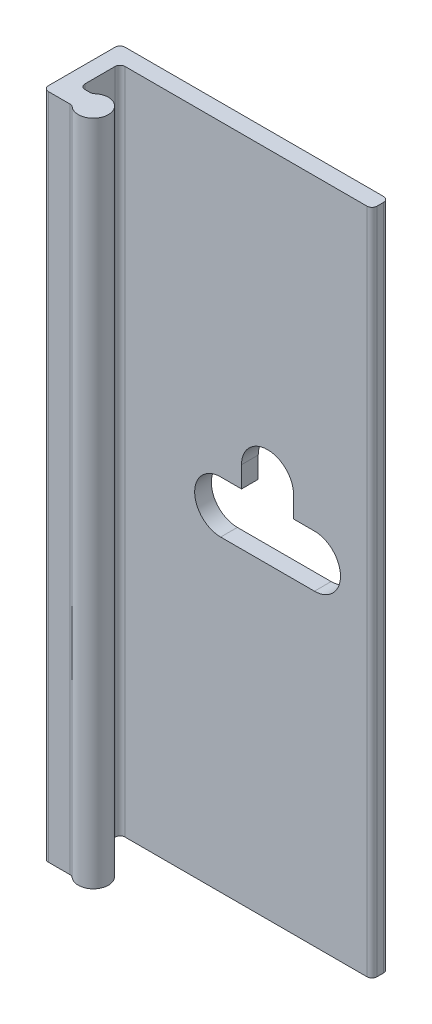
ISO-10303-21;
HEADER;
FILE_DESCRIPTION(('STEP AP214'),'2;1');
FILE_NAME('part.step','',(''),(''),'','','');
FILE_SCHEMA(('AUTOMOTIVE_DESIGN { 1 0 10303 214 1 1 1 1 }'));
ENDSEC;
DATA;
#1=APPLICATION_CONTEXT('core data for automotive mechanical design processes');
#2=APPLICATION_PROTOCOL_DEFINITION('international standard','automotive_design',2000,#1);
#3=PRODUCT_CONTEXT('',#1,'mechanical');
#4=PRODUCT('Part','Part','',(#3));
#5=PRODUCT_RELATED_PRODUCT_CATEGORY('part','',(#4));
#6=PRODUCT_DEFINITION_FORMATION('','',#4);
#7=PRODUCT_DEFINITION_CONTEXT('part definition',#1,'design');
#8=PRODUCT_DEFINITION('design','',#6,#7);
#9=PRODUCT_DEFINITION_SHAPE('','',#8);
#10=(LENGTH_UNIT() NAMED_UNIT(*) SI_UNIT(.MILLI.,.METRE.));
#11=(NAMED_UNIT(*) PLANE_ANGLE_UNIT() SI_UNIT($,.RADIAN.));
#12=(NAMED_UNIT(*) SI_UNIT($,.STERADIAN.) SOLID_ANGLE_UNIT());
#13=UNCERTAINTY_MEASURE_WITH_UNIT(LENGTH_MEASURE(1.E-05),#10,'distance_accuracy_value','');
#14=(GEOMETRIC_REPRESENTATION_CONTEXT(3) GLOBAL_UNCERTAINTY_ASSIGNED_CONTEXT((#13)) GLOBAL_UNIT_ASSIGNED_CONTEXT((#10,
#11,#12)) REPRESENTATION_CONTEXT('',''));
#15=CARTESIAN_POINT('',(0.,0.,0.));
#16=DIRECTION('',(0.,0.,1.));
#17=DIRECTION('',(1.,0.,0.));
#18=AXIS2_PLACEMENT_3D('',#15,#16,#17);
#19=CARTESIAN_POINT('',(-0.634999999999999,50.8,1.651));
#20=DIRECTION('',(1.,0.,0.));
#21=DIRECTION('',(0.,0.,-1.));
#22=AXIS2_PLACEMENT_3D('',#19,#20,#21);
#23=PLANE('',#22);
#24=DIRECTION('',(0.,0.,1.));
#25=VECTOR('',#24,1.);
#26=CARTESIAN_POINT('',(-0.634999999999999,0.,1.651));
#27=LINE('',#26,#25);
#28=CARTESIAN_POINT('',(-0.634999999999999,0.,0.381));
#29=VERTEX_POINT('',#28);
#30=CARTESIAN_POINT('',(-0.634999999999999,0.,5.461));
#31=VERTEX_POINT('',#30);
#32=EDGE_CURVE('E251',#29,#31,#27,.T.);
#33=ORIENTED_EDGE('',*,*,#32,.T.);
#34=DIRECTION('',(0.,-1.,0.));
#35=VECTOR('',#34,1.);
#36=CARTESIAN_POINT('',(-0.634999999999999,50.8,5.461));
#37=LINE('',#36,#35);
#38=CARTESIAN_POINT('',(-0.634999999999999,50.8,5.461));
#39=VERTEX_POINT('',#38);
#40=EDGE_CURVE('E368',#31,#39,#37,.F.);
#41=ORIENTED_EDGE('',*,*,#40,.T.);
#42=DIRECTION('',(0.,0.,1.));
#43=VECTOR('',#42,1.);
#44=CARTESIAN_POINT('',(-0.634999999999999,50.8,1.651));
#45=LINE('',#44,#43);
#46=CARTESIAN_POINT('',(-0.634999999999999,50.8,0.381));
#47=VERTEX_POINT('',#46);
#48=EDGE_CURVE('E263',#47,#39,#45,.T.);
#49=ORIENTED_EDGE('',*,*,#48,.F.);
#50=DIRECTION('',(0.,-1.,0.));
#51=VECTOR('',#50,1.);
#52=CARTESIAN_POINT('',(-0.634999999999999,50.8,0.381));
#53=LINE('',#52,#51);
#54=EDGE_CURVE('E365',#47,#29,#53,.T.);
#55=ORIENTED_EDGE('',*,*,#54,.T.);
#56=EDGE_LOOP('',(#33,#41,#49,#55));
#57=FACE_BOUND('',#56,.T.);
#58=ADVANCED_FACE('F34',(#57),#23,.F.);
#59=CARTESIAN_POINT('',(-1.40496875048439,50.8,5.842));
#60=DIRECTION('',(0.,0.,-1.));
#61=DIRECTION('',(-1.,0.,0.));
#62=AXIS2_PLACEMENT_3D('',#59,#60,#61);
#63=PLANE('',#62);
#64=DIRECTION('',(1.,0.,0.));
#65=VECTOR('',#64,1.);
#66=CARTESIAN_POINT('',(-1.40496875048439,50.8,5.842));
#67=LINE('',#66,#65);
#68=CARTESIAN_POINT('',(-0.253999999999998,50.8,5.842));
#69=VERTEX_POINT('',#68);
#70=CARTESIAN_POINT('',(1.40496875048439,50.8,5.842));
#71=VERTEX_POINT('',#70);
#72=EDGE_CURVE('E266',#69,#71,#67,.T.);
#73=ORIENTED_EDGE('',*,*,#72,.F.);
#74=DIRECTION('',(0.,-1.,0.));
#75=VECTOR('',#74,1.);
#76=CARTESIAN_POINT('',(-0.253999999999998,50.8,5.842));
#77=LINE('',#76,#75);
#78=CARTESIAN_POINT('',(-0.253999999999998,0.,5.842));
#79=VERTEX_POINT('',#78);
#80=EDGE_CURVE('E358',#69,#79,#77,.T.);
#81=ORIENTED_EDGE('',*,*,#80,.T.);
#82=DIRECTION('',(1.,0.,0.));
#83=VECTOR('',#82,1.);
#84=CARTESIAN_POINT('',(-1.40496875048439,0.,5.842));
#85=LINE('',#84,#83);
#86=CARTESIAN_POINT('',(1.40496875048439,0.,5.842));
#87=VERTEX_POINT('',#86);
#88=EDGE_CURVE('E297',#79,#87,#85,.T.);
#89=ORIENTED_EDGE('',*,*,#88,.T.);
#90=DIRECTION('',(0.,-1.,0.));
#91=VECTOR('',#90,1.);
#92=CARTESIAN_POINT('',(1.40496875048439,50.8,5.842));
#93=LINE('',#92,#91);
#94=EDGE_CURVE('E355',#71,#87,#93,.T.);
#95=ORIENTED_EDGE('',*,*,#94,.F.);
#96=EDGE_LOOP('',(#73,#81,#89,#95));
#97=FACE_BOUND('',#96,.T.);
#98=ADVANCED_FACE('F381',(#97),#63,.F.);
#99=CARTESIAN_POINT('',(1.40496875048439,50.8,6.223));
#100=DIRECTION('',(0.,-1.,0.));
#101=DIRECTION('',(0.,0.,-1.));
#102=AXIS2_PLACEMENT_3D('',#99,#100,#101);
#103=CYLINDRICAL_SURFACE('',#102,0.381);
#104=CARTESIAN_POINT('',(1.40496875048439,0.,6.223));
#105=DIRECTION('',(0.,-1.,0.));
#106=DIRECTION('',(0.,0.,-1.));
#107=AXIS2_PLACEMENT_3D('',#104,#105,#106);
#108=CIRCLE('',#107,0.381);
#109=CARTESIAN_POINT('',(1.65697656286329,0.,5.93725));
#110=VERTEX_POINT('',#109);
#111=EDGE_CURVE('E299',#87,#110,#108,.T.);
#112=ORIENTED_EDGE('',*,*,#111,.T.);
#113=DIRECTION('',(0.,-1.,0.));
#114=VECTOR('',#113,1.);
#115=CARTESIAN_POINT('',(1.65697656286329,50.8,5.93725));
#116=LINE('',#115,#114);
#117=CARTESIAN_POINT('',(1.65697656286329,50.8,5.93725));
#118=VERTEX_POINT('',#117);
#119=EDGE_CURVE('E352',#118,#110,#116,.T.);
#120=ORIENTED_EDGE('',*,*,#119,.F.);
#121=CARTESIAN_POINT('',(1.40496875048439,50.8,6.223));
#122=DIRECTION('',(0.,-1.,0.));
#123=DIRECTION('',(0.,0.,-1.));
#124=AXIS2_PLACEMENT_3D('',#121,#122,#123);
#125=CIRCLE('',#124,0.381);
#126=EDGE_CURVE('E269',#71,#118,#125,.T.);
#127=ORIENTED_EDGE('',*,*,#126,.F.);
#128=ORIENTED_EDGE('',*,*,#94,.T.);
#129=EDGE_LOOP('',(#112,#120,#127,#128));
#130=FACE_BOUND('',#129,.T.);
#131=ADVANCED_FACE('F448',(#130),#103,.F.);
#132=CARTESIAN_POINT('',(2.413,50.8,5.08));
#133=DIRECTION('',(0.,-1.,0.));
#134=DIRECTION('',(0.,0.,-1.));
#135=AXIS2_PLACEMENT_3D('',#132,#133,#134);
#136=CYLINDRICAL_SURFACE('',#135,1.143);
#137=CARTESIAN_POINT('',(2.413,0.,5.08));
#138=DIRECTION('',(0.,1.,0.));
#139=DIRECTION('',(0.,0.,1.));
#140=AXIS2_PLACEMENT_3D('',#137,#138,#139);
#141=CIRCLE('',#140,1.143);
#142=CARTESIAN_POINT('',(1.6569765628633,0.,4.22275));
#143=VERTEX_POINT('',#142);
#144=EDGE_CURVE('E301',#110,#143,#141,.T.);
#145=ORIENTED_EDGE('',*,*,#144,.T.);
#146=DIRECTION('',(0.,-1.,0.));
#147=VECTOR('',#146,1.);
#148=CARTESIAN_POINT('',(1.6569765628633,50.8,4.22275));
#149=LINE('',#148,#147);
#150=CARTESIAN_POINT('',(1.6569765628633,50.8,4.22275));
#151=VERTEX_POINT('',#150);
#152=EDGE_CURVE('E349',#151,#143,#149,.T.);
#153=ORIENTED_EDGE('',*,*,#152,.F.);
#154=CARTESIAN_POINT('',(2.413,50.8,5.08));
#155=DIRECTION('',(0.,1.,0.));
#156=DIRECTION('',(0.,0.,1.));
#157=AXIS2_PLACEMENT_3D('',#154,#155,#156);
#158=CIRCLE('',#157,1.143);
#159=EDGE_CURVE('E271',#118,#151,#158,.T.);
#160=ORIENTED_EDGE('',*,*,#159,.F.);
#161=ORIENTED_EDGE('',*,*,#119,.T.);
#162=EDGE_LOOP('',(#145,#153,#160,#161));
#163=FACE_BOUND('',#162,.T.);
#164=ADVANCED_FACE('F445',(#163),#136,.T.);
#165=CARTESIAN_POINT('',(1.40496875048439,50.8,3.937));
#166=DIRECTION('',(0.,-1.,0.));
#167=DIRECTION('',(0.,0.,-1.));
#168=AXIS2_PLACEMENT_3D('',#165,#166,#167);
#169=CYLINDRICAL_SURFACE('',#168,0.381000000000001);
#170=CARTESIAN_POINT('',(1.40496875048439,0.,3.937));
#171=DIRECTION('',(0.,-1.,0.));
#172=DIRECTION('',(0.,0.,-1.));
#173=AXIS2_PLACEMENT_3D('',#170,#171,#172);
#174=CIRCLE('',#173,0.381000000000001);
#175=CARTESIAN_POINT('',(1.40496875048439,0.,4.318));
#176=VERTEX_POINT('',#175);
#177=EDGE_CURVE('E303',#143,#176,#174,.T.);
#178=ORIENTED_EDGE('',*,*,#177,.T.);
#179=DIRECTION('',(0.,-1.,0.));
#180=VECTOR('',#179,1.);
#181=CARTESIAN_POINT('',(1.40496875048439,50.8,4.318));
#182=LINE('',#181,#180);
#183=CARTESIAN_POINT('',(1.40496875048439,50.8,4.318));
#184=VERTEX_POINT('',#183);
#185=EDGE_CURVE('E346',#184,#176,#182,.T.);
#186=ORIENTED_EDGE('',*,*,#185,.F.);
#187=CARTESIAN_POINT('',(1.40496875048439,50.8,3.937));
#188=DIRECTION('',(0.,-1.,0.));
#189=DIRECTION('',(0.,0.,-1.));
#190=AXIS2_PLACEMENT_3D('',#187,#188,#189);
#191=CIRCLE('',#190,0.381000000000001);
#192=EDGE_CURVE('E273',#151,#184,#191,.T.);
#193=ORIENTED_EDGE('',*,*,#192,.F.);
#194=ORIENTED_EDGE('',*,*,#152,.T.);
#195=EDGE_LOOP('',(#178,#186,#193,#194));
#196=FACE_BOUND('',#195,.T.);
#197=ADVANCED_FACE('F441',(#196),#169,.F.);
#198=CARTESIAN_POINT('',(1.016,50.8,4.318));
#199=DIRECTION('',(0.,0.,1.));
#200=DIRECTION('',(1.,0.,0.));
#201=AXIS2_PLACEMENT_3D('',#198,#199,#200);
#202=PLANE('',#201);
#203=DIRECTION('',(-1.,0.,0.));
#204=VECTOR('',#203,1.);
#205=CARTESIAN_POINT('',(1.016,0.,4.318));
#206=LINE('',#205,#204);
#207=CARTESIAN_POINT('',(1.016,0.,4.318));
#208=VERTEX_POINT('',#207);
#209=EDGE_CURVE('E305',#176,#208,#206,.T.);
#210=ORIENTED_EDGE('',*,*,#209,.T.);
#211=DIRECTION('',(0.,-1.,0.));
#212=VECTOR('',#211,1.);
#213=CARTESIAN_POINT('',(1.016,50.8,4.318));
#214=LINE('',#213,#212);
#215=CARTESIAN_POINT('',(1.016,50.8,4.318));
#216=VERTEX_POINT('',#215);
#217=EDGE_CURVE('E343',#216,#208,#214,.T.);
#218=ORIENTED_EDGE('',*,*,#217,.F.);
#219=DIRECTION('',(-1.,0.,0.));
#220=VECTOR('',#219,1.);
#221=CARTESIAN_POINT('',(1.016,50.8,4.318));
#222=LINE('',#221,#220);
#223=EDGE_CURVE('E275',#184,#216,#222,.T.);
#224=ORIENTED_EDGE('',*,*,#223,.F.);
#225=ORIENTED_EDGE('',*,*,#185,.T.);
#226=EDGE_LOOP('',(#210,#218,#224,#225));
#227=FACE_BOUND('',#226,.T.);
#228=ADVANCED_FACE('F436',(#227),#202,.F.);
#229=CARTESIAN_POINT('',(1.016,50.8,3.937));
#230=DIRECTION('',(0.,-1.,0.));
#231=DIRECTION('',(0.,0.,-1.));
#232=AXIS2_PLACEMENT_3D('',#229,#230,#231);
#233=CYLINDRICAL_SURFACE('',#232,0.381);
#234=CARTESIAN_POINT('',(1.016,0.,3.937));
#235=DIRECTION('',(0.,-1.,0.));
#236=DIRECTION('',(0.,0.,1.));
#237=AXIS2_PLACEMENT_3D('',#234,#235,#236);
#238=CIRCLE('',#237,0.381);
#239=CARTESIAN_POINT('',(0.635000000000002,0.,3.937));
#240=VERTEX_POINT('',#239);
#241=EDGE_CURVE('E307',#208,#240,#238,.T.);
#242=ORIENTED_EDGE('',*,*,#241,.T.);
#243=DIRECTION('',(0.,-1.,0.));
#244=VECTOR('',#243,1.);
#245=CARTESIAN_POINT('',(0.635000000000002,50.8,3.937));
#246=LINE('',#245,#244);
#247=CARTESIAN_POINT('',(0.635000000000002,50.8,3.937));
#248=VERTEX_POINT('',#247);
#249=EDGE_CURVE('E340',#248,#240,#246,.T.);
#250=ORIENTED_EDGE('',*,*,#249,.F.);
#251=CARTESIAN_POINT('',(1.016,50.8,3.937));
#252=DIRECTION('',(0.,-1.,0.));
#253=DIRECTION('',(0.,0.,1.));
#254=AXIS2_PLACEMENT_3D('',#251,#252,#253);
#255=CIRCLE('',#254,0.381);
#256=EDGE_CURVE('E277',#216,#248,#255,.T.);
#257=ORIENTED_EDGE('',*,*,#256,.F.);
#258=ORIENTED_EDGE('',*,*,#217,.T.);
#259=EDGE_LOOP('',(#242,#250,#257,#258));
#260=FACE_BOUND('',#259,.T.);
#261=ADVANCED_FACE('F430',(#260),#233,.F.);
#262=CARTESIAN_POINT('',(0.635000000000001,50.8,1.651));
#263=DIRECTION('',(-1.,0.,0.));
#264=DIRECTION('',(0.,0.,1.));
#265=AXIS2_PLACEMENT_3D('',#262,#263,#264);
#266=PLANE('',#265);
#267=DIRECTION('',(0.,0.,-1.));
#268=VECTOR('',#267,1.);
#269=CARTESIAN_POINT('',(0.635000000000001,0.,1.651));
#270=LINE('',#269,#268);
#271=CARTESIAN_POINT('',(0.635000000000001,0.,1.651));
#272=VERTEX_POINT('',#271);
#273=EDGE_CURVE('E309',#240,#272,#270,.T.);
#274=ORIENTED_EDGE('',*,*,#273,.T.);
#275=DIRECTION('',(0.,-1.,0.));
#276=VECTOR('',#275,1.);
#277=CARTESIAN_POINT('',(0.635000000000001,50.8,1.651));
#278=LINE('',#277,#276);
#279=CARTESIAN_POINT('',(0.635000000000001,50.8,1.651));
#280=VERTEX_POINT('',#279);
#281=EDGE_CURVE('E337',#280,#272,#278,.T.);
#282=ORIENTED_EDGE('',*,*,#281,.F.);
#283=DIRECTION('',(0.,0.,-1.));
#284=VECTOR('',#283,1.);
#285=CARTESIAN_POINT('',(0.635000000000001,50.8,1.651));
#286=LINE('',#285,#284);
#287=EDGE_CURVE('E279',#248,#280,#286,.T.);
#288=ORIENTED_EDGE('',*,*,#287,.F.);
#289=ORIENTED_EDGE('',*,*,#249,.T.);
#290=EDGE_LOOP('',(#274,#282,#288,#289));
#291=FACE_BOUND('',#290,.T.);
#292=ADVANCED_FACE('F426',(#291),#266,.F.);
#293=CARTESIAN_POINT('',(1.016,50.8,1.651));
#294=DIRECTION('',(0.,-1.,0.));
#295=DIRECTION('',(0.,0.,-1.));
#296=AXIS2_PLACEMENT_3D('',#293,#294,#295);
#297=CYLINDRICAL_SURFACE('',#296,0.381000000000001);
#298=CARTESIAN_POINT('',(1.016,0.,1.651));
#299=DIRECTION('',(0.,-1.,0.));
#300=DIRECTION('',(0.,0.,1.));
#301=AXIS2_PLACEMENT_3D('',#298,#299,#300);
#302=CIRCLE('',#301,0.381000000000001);
#303=CARTESIAN_POINT('',(1.016,0.,1.27));
#304=VERTEX_POINT('',#303);
#305=EDGE_CURVE('E311',#272,#304,#302,.T.);
#306=ORIENTED_EDGE('',*,*,#305,.T.);
#307=DIRECTION('',(0.,-1.,0.));
#308=VECTOR('',#307,1.);
#309=CARTESIAN_POINT('',(1.016,50.8,1.27));
#310=LINE('',#309,#308);
#311=CARTESIAN_POINT('',(1.016,50.8,1.27));
#312=VERTEX_POINT('',#311);
#313=EDGE_CURVE('E334',#312,#304,#310,.T.);
#314=ORIENTED_EDGE('',*,*,#313,.F.);
#315=CARTESIAN_POINT('',(1.016,50.8,1.651));
#316=DIRECTION('',(0.,-1.,0.));
#317=DIRECTION('',(0.,0.,1.));
#318=AXIS2_PLACEMENT_3D('',#315,#316,#317);
#319=CIRCLE('',#318,0.381000000000001);
#320=EDGE_CURVE('E281',#280,#312,#319,.T.);
#321=ORIENTED_EDGE('',*,*,#320,.F.);
#322=ORIENTED_EDGE('',*,*,#281,.T.);
#323=EDGE_LOOP('',(#306,#314,#321,#322));
#324=FACE_BOUND('',#323,.T.);
#325=ADVANCED_FACE('F421',(#324),#297,.F.);
#326=CARTESIAN_POINT('',(19.431,50.8,1.27));
#327=DIRECTION('',(0.,0.,-1.));
#328=DIRECTION('',(-1.,0.,0.));
#329=AXIS2_PLACEMENT_3D('',#326,#327,#328);
#330=PLANE('',#329);
#331=DIRECTION('',(1.,0.,0.));
#332=VECTOR('',#331,1.);
#333=CARTESIAN_POINT('',(8.2931,23.4188,1.27));
#334=LINE('',#333,#332);
#335=CARTESIAN_POINT('',(8.2931,23.4188,1.27));
#336=VERTEX_POINT('',#335);
#337=CARTESIAN_POINT('',(15.4305,23.4188,1.27));
#338=VERTEX_POINT('',#337);
#339=EDGE_CURVE('E233',#336,#338,#334,.T.);
#340=ORIENTED_EDGE('',*,*,#339,.F.);
#341=CARTESIAN_POINT('',(8.2931,25.4,1.27));
#342=DIRECTION('',(0.,0.,1.));
#343=DIRECTION('',(1.,0.,0.));
#344=AXIS2_PLACEMENT_3D('',#341,#342,#343);
#345=CIRCLE('',#344,1.9812);
#346=CARTESIAN_POINT('',(8.2931,27.3812,1.27));
#347=VERTEX_POINT('',#346);
#348=EDGE_CURVE('E49',#347,#336,#345,.T.);
#349=ORIENTED_EDGE('',*,*,#348,.F.);
#350=DIRECTION('',(-1.,0.,0.));
#351=VECTOR('',#350,1.);
#352=CARTESIAN_POINT('',(8.2931,27.3812,1.27));
#353=LINE('',#352,#351);
#354=CARTESIAN_POINT('',(9.8806,27.3812,1.27));
#355=VERTEX_POINT('',#354);
#356=EDGE_CURVE('E213',#355,#347,#353,.T.);
#357=ORIENTED_EDGE('',*,*,#356,.F.);
#358=DIRECTION('',(0.,-1.,0.));
#359=VECTOR('',#358,1.);
#360=CARTESIAN_POINT('',(9.8806,28.9814000000001,1.27));
#361=LINE('',#360,#359);
#362=CARTESIAN_POINT('',(9.8806,28.9814000000001,1.27));
#363=VERTEX_POINT('',#362);
#364=EDGE_CURVE('E216',#363,#355,#361,.T.);
#365=ORIENTED_EDGE('',*,*,#364,.F.);
#366=CARTESIAN_POINT('',(11.8618,28.9814000000001,1.27));
#367=DIRECTION('',(0.,0.,1.));
#368=DIRECTION('',(1.,0.,0.));
#369=AXIS2_PLACEMENT_3D('',#366,#367,#368);
#370=CIRCLE('',#369,1.9812);
#371=CARTESIAN_POINT('',(13.843,28.9814000000001,1.27));
#372=VERTEX_POINT('',#371);
#373=EDGE_CURVE('E244',#372,#363,#370,.T.);
#374=ORIENTED_EDGE('',*,*,#373,.F.);
#375=DIRECTION('',(0.,1.,0.));
#376=VECTOR('',#375,1.);
#377=CARTESIAN_POINT('',(13.843,28.9814000000001,1.27));
#378=LINE('',#377,#376);
#379=CARTESIAN_POINT('',(13.843,27.3812,1.27));
#380=VERTEX_POINT('',#379);
#381=EDGE_CURVE('E241',#380,#372,#378,.T.);
#382=ORIENTED_EDGE('',*,*,#381,.F.);
#383=DIRECTION('',(-1.,0.,0.));
#384=VECTOR('',#383,1.);
#385=CARTESIAN_POINT('',(13.843,27.3812,1.27));
#386=LINE('',#385,#384);
#387=CARTESIAN_POINT('',(15.4305,27.3812,1.27));
#388=VERTEX_POINT('',#387);
#389=EDGE_CURVE('E238',#388,#380,#386,.T.);
#390=ORIENTED_EDGE('',*,*,#389,.F.);
#391=CARTESIAN_POINT('',(15.4305,25.4,1.27));
#392=DIRECTION('',(0.,0.,1.));
#393=DIRECTION('',(1.,0.,0.));
#394=AXIS2_PLACEMENT_3D('',#391,#392,#393);
#395=CIRCLE('',#394,1.9812);
#396=EDGE_CURVE('E235',#338,#388,#395,.T.);
#397=ORIENTED_EDGE('',*,*,#396,.F.);
#398=EDGE_LOOP('',(#340,#349,#357,#365,#374,#382,#390,#397));
#399=FACE_BOUND('',#398,.T.);
#400=DIRECTION('',(1.,0.,0.));
#401=VECTOR('',#400,1.);
#402=CARTESIAN_POINT('',(19.431,0.,1.27));
#403=LINE('',#402,#401);
#404=CARTESIAN_POINT('',(19.431,0.,1.27));
#405=VERTEX_POINT('',#404);
#406=EDGE_CURVE('E313',#304,#405,#403,.T.);
#407=ORIENTED_EDGE('',*,*,#406,.T.);
#408=DIRECTION('',(0.,-1.,0.));
#409=VECTOR('',#408,1.);
#410=CARTESIAN_POINT('',(19.431,50.8,1.27));
#411=LINE('',#410,#409);
#412=CARTESIAN_POINT('',(19.431,50.8,1.27));
#413=VERTEX_POINT('',#412);
#414=EDGE_CURVE('E331',#413,#405,#411,.T.);
#415=ORIENTED_EDGE('',*,*,#414,.F.);
#416=DIRECTION('',(1.,0.,0.));
#417=VECTOR('',#416,1.);
#418=CARTESIAN_POINT('',(19.431,50.8,1.27));
#419=LINE('',#418,#417);
#420=EDGE_CURVE('E283',#312,#413,#419,.T.);
#421=ORIENTED_EDGE('',*,*,#420,.F.);
#422=ORIENTED_EDGE('',*,*,#313,.T.);
#423=EDGE_LOOP('',(#407,#415,#421,#422));
#424=FACE_BOUND('',#423,.T.);
#425=ADVANCED_FACE('F415',(#399,#424),#330,.F.);
#426=CARTESIAN_POINT('',(19.431,50.8,0.889));
#427=DIRECTION('',(0.,-1.,0.));
#428=DIRECTION('',(0.,0.,-1.));
#429=AXIS2_PLACEMENT_3D('',#426,#427,#428);
#430=CYLINDRICAL_SURFACE('',#429,0.381000000000002);
#431=CARTESIAN_POINT('',(19.431,0.,0.889));
#432=DIRECTION('',(0.,1.,0.));
#433=DIRECTION('',(0.,0.,-1.));
#434=AXIS2_PLACEMENT_3D('',#431,#432,#433);
#435=CIRCLE('',#434,0.381000000000002);
#436=CARTESIAN_POINT('',(19.812,0.,0.889));
#437=VERTEX_POINT('',#436);
#438=EDGE_CURVE('E315',#405,#437,#435,.T.);
#439=ORIENTED_EDGE('',*,*,#438,.T.);
#440=DIRECTION('',(0.,-1.,0.));
#441=VECTOR('',#440,1.);
#442=CARTESIAN_POINT('',(19.812,50.8,0.889));
#443=LINE('',#442,#441);
#444=CARTESIAN_POINT('',(19.812,50.8,0.889));
#445=VERTEX_POINT('',#444);
#446=EDGE_CURVE('E328',#445,#437,#443,.T.);
#447=ORIENTED_EDGE('',*,*,#446,.F.);
#448=CARTESIAN_POINT('',(19.431,50.8,0.889));
#449=DIRECTION('',(0.,1.,0.));
#450=DIRECTION('',(0.,0.,-1.));
#451=AXIS2_PLACEMENT_3D('',#448,#449,#450);
#452=CIRCLE('',#451,0.381000000000002);
#453=EDGE_CURVE('E285',#413,#445,#452,.T.);
#454=ORIENTED_EDGE('',*,*,#453,.F.);
#455=ORIENTED_EDGE('',*,*,#414,.T.);
#456=EDGE_LOOP('',(#439,#447,#454,#455));
#457=FACE_BOUND('',#456,.T.);
#458=ADVANCED_FACE('F411',(#457),#430,.T.);
#459=CARTESIAN_POINT('',(19.812,50.8,0.381));
#460=DIRECTION('',(-1.,0.,0.));
#461=DIRECTION('',(0.,0.,1.));
#462=AXIS2_PLACEMENT_3D('',#459,#460,#461);
#463=PLANE('',#462);
#464=DIRECTION('',(0.,0.,-1.));
#465=VECTOR('',#464,1.);
#466=CARTESIAN_POINT('',(19.812,0.,0.381));
#467=LINE('',#466,#465);
#468=CARTESIAN_POINT('',(19.812,0.,0.381));
#469=VERTEX_POINT('',#468);
#470=EDGE_CURVE('E317',#437,#469,#467,.T.);
#471=ORIENTED_EDGE('',*,*,#470,.T.);
#472=DIRECTION('',(0.,-1.,0.));
#473=VECTOR('',#472,1.);
#474=CARTESIAN_POINT('',(19.812,50.8,0.381));
#475=LINE('',#474,#473);
#476=CARTESIAN_POINT('',(19.812,50.8,0.381));
#477=VERTEX_POINT('',#476);
#478=EDGE_CURVE('E325',#477,#469,#475,.T.);
#479=ORIENTED_EDGE('',*,*,#478,.F.);
#480=DIRECTION('',(0.,0.,-1.));
#481=VECTOR('',#480,1.);
#482=CARTESIAN_POINT('',(19.812,50.8,0.381));
#483=LINE('',#482,#481);
#484=EDGE_CURVE('E287',#445,#477,#483,.T.);
#485=ORIENTED_EDGE('',*,*,#484,.F.);
#486=ORIENTED_EDGE('',*,*,#446,.T.);
#487=EDGE_LOOP('',(#471,#479,#485,#486));
#488=FACE_BOUND('',#487,.T.);
#489=ADVANCED_FACE('F406',(#488),#463,.F.);
#490=CARTESIAN_POINT('',(19.431,50.8,0.381));
#491=DIRECTION('',(0.,-1.,0.));
#492=DIRECTION('',(0.,0.,-1.));
#493=AXIS2_PLACEMENT_3D('',#490,#491,#492);
#494=CYLINDRICAL_SURFACE('',#493,0.381000000000002);
#495=CARTESIAN_POINT('',(19.431,0.,0.381));
#496=DIRECTION('',(0.,1.,0.));
#497=DIRECTION('',(0.,0.,-1.));
#498=AXIS2_PLACEMENT_3D('',#495,#496,#497);
#499=CIRCLE('',#498,0.381000000000002);
#500=CARTESIAN_POINT('',(19.431,0.,0.));
#501=VERTEX_POINT('',#500);
#502=EDGE_CURVE('E319',#469,#501,#499,.T.);
#503=ORIENTED_EDGE('',*,*,#502,.T.);
#504=DIRECTION('',(0.,-1.,0.));
#505=VECTOR('',#504,1.);
#506=CARTESIAN_POINT('',(19.431,50.8,0.));
#507=LINE('',#506,#505);
#508=CARTESIAN_POINT('',(19.431,50.8,0.));
#509=VERTEX_POINT('',#508);
#510=EDGE_CURVE('E294',#509,#501,#507,.T.);
#511=ORIENTED_EDGE('',*,*,#510,.F.);
#512=CARTESIAN_POINT('',(19.431,50.8,0.381));
#513=DIRECTION('',(0.,1.,0.));
#514=DIRECTION('',(0.,0.,-1.));
#515=AXIS2_PLACEMENT_3D('',#512,#513,#514);
#516=CIRCLE('',#515,0.381000000000002);
#517=EDGE_CURVE('E289',#477,#509,#516,.T.);
#518=ORIENTED_EDGE('',*,*,#517,.F.);
#519=ORIENTED_EDGE('',*,*,#478,.T.);
#520=EDGE_LOOP('',(#503,#511,#518,#519));
#521=FACE_BOUND('',#520,.T.);
#522=ADVANCED_FACE('F400',(#521),#494,.T.);
#523=CARTESIAN_POINT('',(-5.96900000000001,50.8,0.));
#524=DIRECTION('',(0.,0.,1.));
#525=DIRECTION('',(1.,0.,0.));
#526=AXIS2_PLACEMENT_3D('',#523,#524,#525);
#527=PLANE('',#526);
#528=DIRECTION('',(-1.,0.,0.));
#529=VECTOR('',#528,1.);
#530=CARTESIAN_POINT('',(8.2931,27.3812,0.));
#531=LINE('',#530,#529);
#532=CARTESIAN_POINT('',(9.8806,27.3812,0.));
#533=VERTEX_POINT('',#532);
#534=CARTESIAN_POINT('',(8.2931,27.3812,0.));
#535=VERTEX_POINT('',#534);
#536=EDGE_CURVE('E202',#533,#535,#531,.T.);
#537=ORIENTED_EDGE('',*,*,#536,.T.);
#538=CARTESIAN_POINT('',(8.2931,25.4,0.));
#539=DIRECTION('',(0.,0.,1.));
#540=DIRECTION('',(1.,0.,0.));
#541=AXIS2_PLACEMENT_3D('',#538,#539,#540);
#542=CIRCLE('',#541,1.9812);
#543=CARTESIAN_POINT('',(8.2931,23.4188,0.));
#544=VERTEX_POINT('',#543);
#545=EDGE_CURVE('E196',#535,#544,#542,.T.);
#546=ORIENTED_EDGE('',*,*,#545,.T.);
#547=DIRECTION('',(1.,0.,0.));
#548=VECTOR('',#547,1.);
#549=CARTESIAN_POINT('',(8.2931,23.4188,0.));
#550=LINE('',#549,#548);
#551=CARTESIAN_POINT('',(15.4305,23.4188,0.));
#552=VERTEX_POINT('',#551);
#553=EDGE_CURVE('E205',#544,#552,#550,.T.);
#554=ORIENTED_EDGE('',*,*,#553,.T.);
#555=CARTESIAN_POINT('',(15.4305,25.4,0.));
#556=DIRECTION('',(0.,0.,1.));
#557=DIRECTION('',(1.,0.,0.));
#558=AXIS2_PLACEMENT_3D('',#555,#556,#557);
#559=CIRCLE('',#558,1.9812);
#560=CARTESIAN_POINT('',(15.4305,27.3812,0.));
#561=VERTEX_POINT('',#560);
#562=EDGE_CURVE('E57',#552,#561,#559,.T.);
#563=ORIENTED_EDGE('',*,*,#562,.T.);
#564=DIRECTION('',(-1.,0.,0.));
#565=VECTOR('',#564,1.);
#566=CARTESIAN_POINT('',(13.843,27.3812,0.));
#567=LINE('',#566,#565);
#568=CARTESIAN_POINT('',(13.843,27.3812,0.));
#569=VERTEX_POINT('',#568);
#570=EDGE_CURVE('E220',#561,#569,#567,.T.);
#571=ORIENTED_EDGE('',*,*,#570,.T.);
#572=DIRECTION('',(0.,1.,0.));
#573=VECTOR('',#572,1.);
#574=CARTESIAN_POINT('',(13.843,28.9814000000001,0.));
#575=LINE('',#574,#573);
#576=CARTESIAN_POINT('',(13.843,28.9814000000001,0.));
#577=VERTEX_POINT('',#576);
#578=EDGE_CURVE('E223',#569,#577,#575,.T.);
#579=ORIENTED_EDGE('',*,*,#578,.T.);
#580=CARTESIAN_POINT('',(11.8618,28.9814000000001,0.));
#581=DIRECTION('',(0.,0.,1.));
#582=DIRECTION('',(1.,0.,0.));
#583=AXIS2_PLACEMENT_3D('',#580,#581,#582);
#584=CIRCLE('',#583,1.9812);
#585=CARTESIAN_POINT('',(9.8806,28.9814000000001,0.));
#586=VERTEX_POINT('',#585);
#587=EDGE_CURVE('E226',#577,#586,#584,.T.);
#588=ORIENTED_EDGE('',*,*,#587,.T.);
#589=DIRECTION('',(0.,-1.,0.));
#590=VECTOR('',#589,1.);
#591=CARTESIAN_POINT('',(9.8806,28.9814000000001,0.));
#592=LINE('',#591,#590);
#593=EDGE_CURVE('E229',#586,#533,#592,.T.);
#594=ORIENTED_EDGE('',*,*,#593,.T.);
#595=EDGE_LOOP('',(#537,#546,#554,#563,#571,#579,#588,#594));
#596=FACE_BOUND('',#595,.T.);
#597=DIRECTION('',(-1.,0.,0.));
#598=VECTOR('',#597,1.);
#599=CARTESIAN_POINT('',(-5.96900000000001,0.,0.));
#600=LINE('',#599,#598);
#601=CARTESIAN_POINT('',(-0.253999999999999,0.,0.));
#602=VERTEX_POINT('',#601);
#603=EDGE_CURVE('E267',#501,#602,#600,.T.);
#604=ORIENTED_EDGE('',*,*,#603,.T.);
#605=DIRECTION('',(0.,-1.,0.));
#606=VECTOR('',#605,1.);
#607=CARTESIAN_POINT('',(-0.253999999999999,50.8,0.));
#608=LINE('',#607,#606);
#609=CARTESIAN_POINT('',(-0.253999999999999,50.8,0.));
#610=VERTEX_POINT('',#609);
#611=EDGE_CURVE('E11',#602,#610,#608,.F.);
#612=ORIENTED_EDGE('',*,*,#611,.T.);
#613=DIRECTION('',(-1.,0.,0.));
#614=VECTOR('',#613,1.);
#615=CARTESIAN_POINT('',(-5.96900000000001,50.8,0.));
#616=LINE('',#615,#614);
#617=EDGE_CURVE('E291',#509,#610,#616,.T.);
#618=ORIENTED_EDGE('',*,*,#617,.F.);
#619=ORIENTED_EDGE('',*,*,#510,.T.);
#620=EDGE_LOOP('',(#604,#612,#618,#619));
#621=FACE_BOUND('',#620,.T.);
#622=ADVANCED_FACE('F209',(#596,#621),#527,.F.);
#623=CARTESIAN_POINT('',(-5.96900000000001,50.8,0.381));
#624=DIRECTION('',(0.,-1.,0.));
#625=DIRECTION('',(0.,0.,-1.));
#626=AXIS2_PLACEMENT_3D('',#623,#624,#625);
#627=PLANE('',#626);
#628=ORIENTED_EDGE('',*,*,#48,.T.);
#629=CARTESIAN_POINT('',(-0.253999999999998,50.8,5.461));
#630=DIRECTION('',(0.,-1.,0.));
#631=DIRECTION('',(0.,0.,-1.));
#632=AXIS2_PLACEMENT_3D('',#629,#630,#631);
#633=CIRCLE('',#632,0.381);
#634=EDGE_CURVE('E42',#39,#69,#633,.F.);
#635=ORIENTED_EDGE('',*,*,#634,.T.);
#636=ORIENTED_EDGE('',*,*,#72,.T.);
#637=ORIENTED_EDGE('',*,*,#126,.T.);
#638=ORIENTED_EDGE('',*,*,#159,.T.);
#639=ORIENTED_EDGE('',*,*,#192,.T.);
#640=ORIENTED_EDGE('',*,*,#223,.T.);
#641=ORIENTED_EDGE('',*,*,#256,.T.);
#642=ORIENTED_EDGE('',*,*,#287,.T.);
#643=ORIENTED_EDGE('',*,*,#320,.T.);
#644=ORIENTED_EDGE('',*,*,#420,.T.);
#645=ORIENTED_EDGE('',*,*,#453,.T.);
#646=ORIENTED_EDGE('',*,*,#484,.T.);
#647=ORIENTED_EDGE('',*,*,#517,.T.);
#648=ORIENTED_EDGE('',*,*,#617,.T.);
#649=CARTESIAN_POINT('',(-0.253999999999999,50.8,0.381));
#650=DIRECTION('',(0.,-1.,0.));
#651=DIRECTION('',(0.,0.,-1.));
#652=AXIS2_PLACEMENT_3D('',#649,#650,#651);
#653=CIRCLE('',#652,0.381);
#654=EDGE_CURVE('E370',#610,#47,#653,.F.);
#655=ORIENTED_EDGE('',*,*,#654,.T.);
#656=EDGE_LOOP('',(#628,#635,#636,#637,#638,#639,#640,#641,#642,#643,#644,#645,#646,#647,#648,#655));
#657=FACE_BOUND('',#656,.T.);
#658=ADVANCED_FACE('F374',(#657),#627,.F.);
#659=CARTESIAN_POINT('',(-5.96900000000001,0.,0.381));
#660=DIRECTION('',(0.,-1.,0.));
#661=DIRECTION('',(0.,0.,-1.));
#662=AXIS2_PLACEMENT_3D('',#659,#660,#661);
#663=PLANE('',#662);
#664=ORIENTED_EDGE('',*,*,#88,.F.);
#665=CARTESIAN_POINT('',(-0.253999999999998,0.,5.461));
#666=DIRECTION('',(0.,-1.,0.));
#667=DIRECTION('',(0.,0.,-1.));
#668=AXIS2_PLACEMENT_3D('',#665,#666,#667);
#669=CIRCLE('',#668,0.381);
#670=EDGE_CURVE('E363',#79,#31,#669,.T.);
#671=ORIENTED_EDGE('',*,*,#670,.T.);
#672=ORIENTED_EDGE('',*,*,#32,.F.);
#673=CARTESIAN_POINT('',(-0.253999999999999,0.,0.381));
#674=DIRECTION('',(0.,-1.,0.));
#675=DIRECTION('',(0.,0.,-1.));
#676=AXIS2_PLACEMENT_3D('',#673,#674,#675);
#677=CIRCLE('',#676,0.381);
#678=EDGE_CURVE('E361',#29,#602,#677,.T.);
#679=ORIENTED_EDGE('',*,*,#678,.T.);
#680=ORIENTED_EDGE('',*,*,#603,.F.);
#681=ORIENTED_EDGE('',*,*,#502,.F.);
#682=ORIENTED_EDGE('',*,*,#470,.F.);
#683=ORIENTED_EDGE('',*,*,#438,.F.);
#684=ORIENTED_EDGE('',*,*,#406,.F.);
#685=ORIENTED_EDGE('',*,*,#305,.F.);
#686=ORIENTED_EDGE('',*,*,#273,.F.);
#687=ORIENTED_EDGE('',*,*,#241,.F.);
#688=ORIENTED_EDGE('',*,*,#209,.F.);
#689=ORIENTED_EDGE('',*,*,#177,.F.);
#690=ORIENTED_EDGE('',*,*,#144,.F.);
#691=ORIENTED_EDGE('',*,*,#111,.F.);
#692=EDGE_LOOP('',(#664,#671,#672,#679,#680,#681,#682,#683,#684,#685,#686,#687,#688,#689,#690,#691));
#693=FACE_BOUND('',#692,.T.);
#694=ADVANCED_FACE('F387',(#693),#663,.T.);
#695=CARTESIAN_POINT('',(-0.253999999999998,50.8,5.461));
#696=DIRECTION('',(0.,-1.,0.));
#697=DIRECTION('',(0.,0.,-1.));
#698=AXIS2_PLACEMENT_3D('',#695,#696,#697);
#699=CYLINDRICAL_SURFACE('',#698,0.381);
#700=ORIENTED_EDGE('',*,*,#634,.F.);
#701=ORIENTED_EDGE('',*,*,#40,.F.);
#702=ORIENTED_EDGE('',*,*,#670,.F.);
#703=ORIENTED_EDGE('',*,*,#80,.F.);
#704=EDGE_LOOP('',(#700,#701,#702,#703));
#705=FACE_BOUND('',#704,.T.);
#706=ADVANCED_FACE('F384',(#705),#699,.T.);
#707=CARTESIAN_POINT('',(-0.253999999999999,50.8,0.381));
#708=DIRECTION('',(0.,-1.,0.));
#709=DIRECTION('',(0.,0.,-1.));
#710=AXIS2_PLACEMENT_3D('',#707,#708,#709);
#711=CYLINDRICAL_SURFACE('',#710,0.381);
#712=ORIENTED_EDGE('',*,*,#654,.F.);
#713=ORIENTED_EDGE('',*,*,#611,.F.);
#714=ORIENTED_EDGE('',*,*,#678,.F.);
#715=ORIENTED_EDGE('',*,*,#54,.F.);
#716=EDGE_LOOP('',(#712,#713,#714,#715));
#717=FACE_BOUND('',#716,.T.);
#718=ADVANCED_FACE('F36',(#717),#711,.T.);
#719=CARTESIAN_POINT('',(8.2931,25.4,0.));
#720=DIRECTION('',(0.,0.,1.));
#721=DIRECTION('',(1.,0.,0.));
#722=AXIS2_PLACEMENT_3D('',#719,#720,#721);
#723=CYLINDRICAL_SURFACE('',#722,1.9812);
#724=ORIENTED_EDGE('',*,*,#348,.T.);
#725=DIRECTION('',(0.,0.,1.));
#726=VECTOR('',#725,1.);
#727=CARTESIAN_POINT('',(8.2931,23.4188,0.));
#728=LINE('',#727,#726);
#729=EDGE_CURVE('E192',#544,#336,#728,.T.);
#730=ORIENTED_EDGE('',*,*,#729,.F.);
#731=ORIENTED_EDGE('',*,*,#545,.F.);
#732=DIRECTION('',(0.,0.,1.));
#733=VECTOR('',#732,1.);
#734=CARTESIAN_POINT('',(8.2931,27.3812,0.));
#735=LINE('',#734,#733);
#736=EDGE_CURVE('E249',#535,#347,#735,.T.);
#737=ORIENTED_EDGE('',*,*,#736,.T.);
#738=EDGE_LOOP('',(#724,#730,#731,#737));
#739=FACE_BOUND('',#738,.T.);
#740=ADVANCED_FACE('F194',(#739),#723,.F.);
#741=CARTESIAN_POINT('',(8.2931,27.3812,0.));
#742=DIRECTION('',(0.,1.,0.));
#743=DIRECTION('',(0.,0.,1.));
#744=AXIS2_PLACEMENT_3D('',#741,#742,#743);
#745=PLANE('',#744);
#746=ORIENTED_EDGE('',*,*,#356,.T.);
#747=ORIENTED_EDGE('',*,*,#736,.F.);
#748=ORIENTED_EDGE('',*,*,#536,.F.);
#749=DIRECTION('',(0.,0.,1.));
#750=VECTOR('',#749,1.);
#751=CARTESIAN_POINT('',(9.8806,27.3812,0.));
#752=LINE('',#751,#750);
#753=EDGE_CURVE('E252',#533,#355,#752,.T.);
#754=ORIENTED_EDGE('',*,*,#753,.T.);
#755=EDGE_LOOP('',(#746,#747,#748,#754));
#756=FACE_BOUND('',#755,.T.);
#757=ADVANCED_FACE('F564',(#756),#745,.F.);
#758=CARTESIAN_POINT('',(9.8806,28.9814000000001,0.));
#759=DIRECTION('',(-1.,0.,0.));
#760=DIRECTION('',(0.,0.,1.));
#761=AXIS2_PLACEMENT_3D('',#758,#759,#760);
#762=PLANE('',#761);
#763=ORIENTED_EDGE('',*,*,#364,.T.);
#764=ORIENTED_EDGE('',*,*,#753,.F.);
#765=ORIENTED_EDGE('',*,*,#593,.F.);
#766=DIRECTION('',(0.,0.,1.));
#767=VECTOR('',#766,1.);
#768=CARTESIAN_POINT('',(9.8806,28.9814000000001,0.));
#769=LINE('',#768,#767);
#770=EDGE_CURVE('E254',#586,#363,#769,.T.);
#771=ORIENTED_EDGE('',*,*,#770,.T.);
#772=EDGE_LOOP('',(#763,#764,#765,#771));
#773=FACE_BOUND('',#772,.T.);
#774=ADVANCED_FACE('F569',(#773),#762,.F.);
#775=CARTESIAN_POINT('',(11.8618,28.9814000000001,0.));
#776=DIRECTION('',(0.,0.,1.));
#777=DIRECTION('',(1.,0.,0.));
#778=AXIS2_PLACEMENT_3D('',#775,#776,#777);
#779=CYLINDRICAL_SURFACE('',#778,1.9812);
#780=ORIENTED_EDGE('',*,*,#373,.T.);
#781=ORIENTED_EDGE('',*,*,#770,.F.);
#782=ORIENTED_EDGE('',*,*,#587,.F.);
#783=DIRECTION('',(0.,0.,1.));
#784=VECTOR('',#783,1.);
#785=CARTESIAN_POINT('',(13.843,28.9814000000001,0.));
#786=LINE('',#785,#784);
#787=EDGE_CURVE('E256',#577,#372,#786,.T.);
#788=ORIENTED_EDGE('',*,*,#787,.T.);
#789=EDGE_LOOP('',(#780,#781,#782,#788));
#790=FACE_BOUND('',#789,.T.);
#791=ADVANCED_FACE('F577',(#790),#779,.F.);
#792=CARTESIAN_POINT('',(13.843,28.9814000000001,0.));
#793=DIRECTION('',(1.,0.,0.));
#794=DIRECTION('',(0.,0.,-1.));
#795=AXIS2_PLACEMENT_3D('',#792,#793,#794);
#796=PLANE('',#795);
#797=ORIENTED_EDGE('',*,*,#381,.T.);
#798=ORIENTED_EDGE('',*,*,#787,.F.);
#799=ORIENTED_EDGE('',*,*,#578,.F.);
#800=DIRECTION('',(0.,0.,1.));
#801=VECTOR('',#800,1.);
#802=CARTESIAN_POINT('',(13.843,27.3812,0.));
#803=LINE('',#802,#801);
#804=EDGE_CURVE('E258',#569,#380,#803,.T.);
#805=ORIENTED_EDGE('',*,*,#804,.T.);
#806=EDGE_LOOP('',(#797,#798,#799,#805));
#807=FACE_BOUND('',#806,.T.);
#808=ADVANCED_FACE('F585',(#807),#796,.F.);
#809=CARTESIAN_POINT('',(13.843,27.3812,0.));
#810=DIRECTION('',(0.,1.,0.));
#811=DIRECTION('',(0.,0.,1.));
#812=AXIS2_PLACEMENT_3D('',#809,#810,#811);
#813=PLANE('',#812);
#814=ORIENTED_EDGE('',*,*,#389,.T.);
#815=ORIENTED_EDGE('',*,*,#804,.F.);
#816=ORIENTED_EDGE('',*,*,#570,.F.);
#817=DIRECTION('',(0.,0.,1.));
#818=VECTOR('',#817,1.);
#819=CARTESIAN_POINT('',(15.4305,27.3812,0.));
#820=LINE('',#819,#818);
#821=EDGE_CURVE('E260',#561,#388,#820,.T.);
#822=ORIENTED_EDGE('',*,*,#821,.T.);
#823=EDGE_LOOP('',(#814,#815,#816,#822));
#824=FACE_BOUND('',#823,.T.);
#825=ADVANCED_FACE('F593',(#824),#813,.F.);
#826=CARTESIAN_POINT('',(15.4305,25.4,0.));
#827=DIRECTION('',(0.,0.,1.));
#828=DIRECTION('',(1.,0.,0.));
#829=AXIS2_PLACEMENT_3D('',#826,#827,#828);
#830=CYLINDRICAL_SURFACE('',#829,1.9812);
#831=ORIENTED_EDGE('',*,*,#396,.T.);
#832=ORIENTED_EDGE('',*,*,#821,.F.);
#833=ORIENTED_EDGE('',*,*,#562,.F.);
#834=DIRECTION('',(0.,0.,1.));
#835=VECTOR('',#834,1.);
#836=CARTESIAN_POINT('',(15.4305,23.4188,0.));
#837=LINE('',#836,#835);
#838=EDGE_CURVE('E201',#552,#338,#837,.T.);
#839=ORIENTED_EDGE('',*,*,#838,.T.);
#840=EDGE_LOOP('',(#831,#832,#833,#839));
#841=FACE_BOUND('',#840,.T.);
#842=ADVANCED_FACE('F601',(#841),#830,.F.);
#843=CARTESIAN_POINT('',(8.2931,23.4188,0.));
#844=DIRECTION('',(0.,-1.,0.));
#845=DIRECTION('',(0.,0.,-1.));
#846=AXIS2_PLACEMENT_3D('',#843,#844,#845);
#847=PLANE('',#846);
#848=ORIENTED_EDGE('',*,*,#339,.T.);
#849=ORIENTED_EDGE('',*,*,#838,.F.);
#850=ORIENTED_EDGE('',*,*,#553,.F.);
#851=ORIENTED_EDGE('',*,*,#729,.T.);
#852=EDGE_LOOP('',(#848,#849,#850,#851));
#853=FACE_BOUND('',#852,.T.);
#854=ADVANCED_FACE('F206',(#853),#847,.F.);
#855=CLOSED_SHELL('',(#58,#98,#131,#164,#197,#228,#261,#292,#325,#425,#458,#489,#522,#622,#658,
#694,#706,#718,#740,#757,#774,#791,#808,#825,#842,#854));
#856=MANIFOLD_SOLID_BREP('B2',#855);
#857=ADVANCED_BREP_SHAPE_REPRESENTATION('',(#18,#856),#14);
#858=SHAPE_DEFINITION_REPRESENTATION(#9,#857);
ENDSEC;
END-ISO-10303-21;
